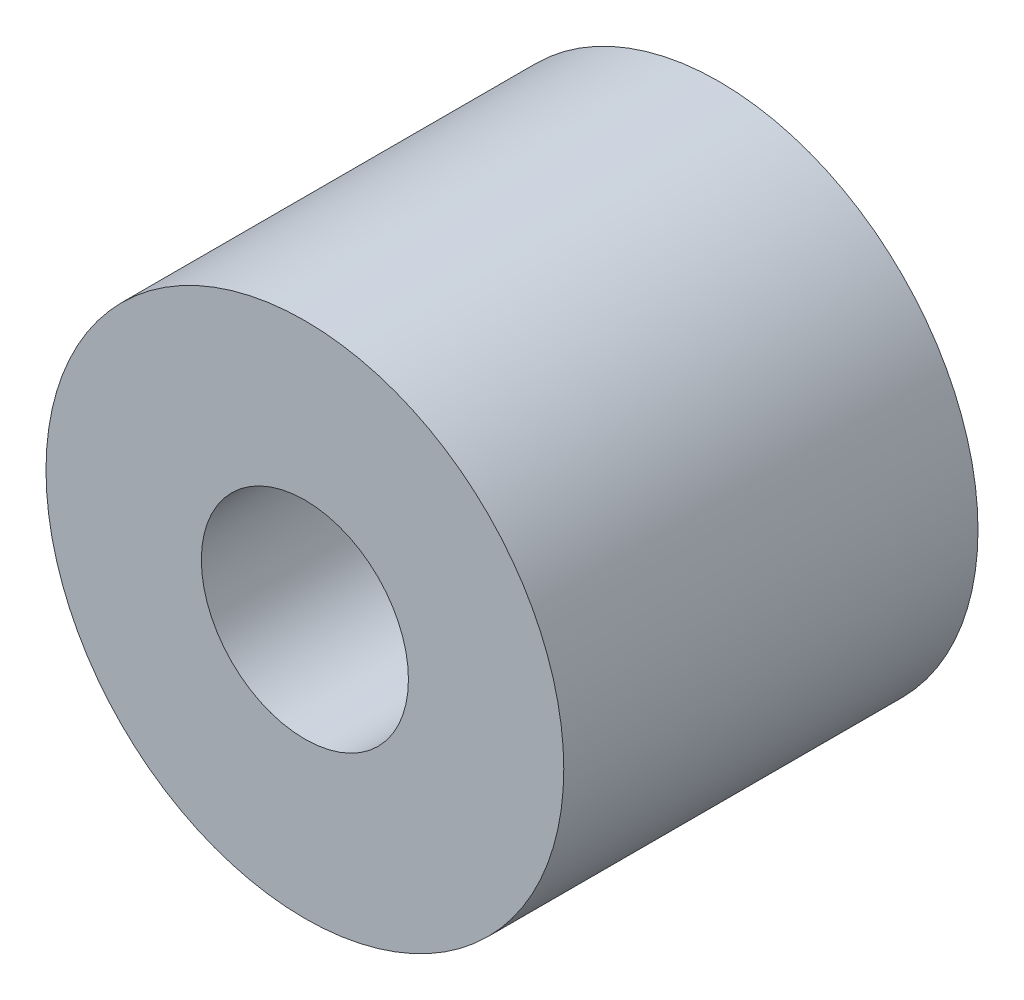
ISO-10303-21;
HEADER;
FILE_DESCRIPTION(('STEP AP214'),'2;1');
FILE_NAME('part.step','',(''),(''),'','','');
FILE_SCHEMA(('AUTOMOTIVE_DESIGN { 1 0 10303 214 1 1 1 1 }'));
ENDSEC;
DATA;
#1=APPLICATION_CONTEXT('core data for automotive mechanical design processes');
#2=APPLICATION_PROTOCOL_DEFINITION('international standard','automotive_design',2000,#1);
#3=PRODUCT_CONTEXT('',#1,'mechanical');
#4=PRODUCT('Part','Part','',(#3));
#5=PRODUCT_RELATED_PRODUCT_CATEGORY('part','',(#4));
#6=PRODUCT_DEFINITION_FORMATION('','',#4);
#7=PRODUCT_DEFINITION_CONTEXT('part definition',#1,'design');
#8=PRODUCT_DEFINITION('design','',#6,#7);
#9=PRODUCT_DEFINITION_SHAPE('','',#8);
#10=(LENGTH_UNIT() NAMED_UNIT(*) SI_UNIT(.MILLI.,.METRE.));
#11=(NAMED_UNIT(*) PLANE_ANGLE_UNIT() SI_UNIT($,.RADIAN.));
#12=(NAMED_UNIT(*) SI_UNIT($,.STERADIAN.) SOLID_ANGLE_UNIT());
#13=UNCERTAINTY_MEASURE_WITH_UNIT(LENGTH_MEASURE(1.E-05),#10,'distance_accuracy_value','');
#14=(GEOMETRIC_REPRESENTATION_CONTEXT(3) GLOBAL_UNCERTAINTY_ASSIGNED_CONTEXT((#13)) GLOBAL_UNIT_ASSIGNED_CONTEXT((#10,
#11,#12)) REPRESENTATION_CONTEXT('',''));
#15=CARTESIAN_POINT('',(0.,0.,0.));
#16=DIRECTION('',(0.,0.,1.));
#17=DIRECTION('',(1.,0.,0.));
#18=AXIS2_PLACEMENT_3D('',#15,#16,#17);
#19=CARTESIAN_POINT('',(0.,0.,12.7));
#20=DIRECTION('',(0.,0.,1.));
#21=DIRECTION('',(1.,0.,0.));
#22=AXIS2_PLACEMENT_3D('',#19,#20,#21);
#23=PLANE('',#22);
#24=CARTESIAN_POINT('',(0.,0.,12.7));
#25=DIRECTION('',(0.,0.,1.));
#26=DIRECTION('',(1.,0.,0.));
#27=AXIS2_PLACEMENT_3D('',#24,#25,#26);
#28=CIRCLE('',#27,7.9375);
#29=CARTESIAN_POINT('',(7.9375,0.,12.7));
#30=VERTEX_POINT('',#29);
#31=EDGE_CURVE('E10',#30,#30,#28,.T.);
#32=ORIENTED_EDGE('',*,*,#31,.T.);
#33=EDGE_LOOP('',(#32));
#34=FACE_BOUND('',#33,.T.);
#35=CARTESIAN_POINT('',(0.,0.,12.7));
#36=DIRECTION('',(0.,0.,1.));
#37=DIRECTION('',(1.,0.,0.));
#38=AXIS2_PLACEMENT_3D('',#35,#36,#37);
#39=CIRCLE('',#38,3.175);
#40=CARTESIAN_POINT('',(3.175,0.,12.7));
#41=VERTEX_POINT('',#40);
#42=EDGE_CURVE('E43',#41,#41,#39,.T.);
#43=ORIENTED_EDGE('',*,*,#42,.F.);
#44=EDGE_LOOP('',(#43));
#45=FACE_BOUND('',#44,.T.);
#46=ADVANCED_FACE('F32',(#34,#45),#23,.T.);
#47=CARTESIAN_POINT('',(0.,0.,0.));
#48=DIRECTION('',(0.,0.,1.));
#49=DIRECTION('',(1.,0.,0.));
#50=AXIS2_PLACEMENT_3D('',#47,#48,#49);
#51=PLANE('',#50);
#52=CARTESIAN_POINT('',(0.,0.,0.));
#53=DIRECTION('',(0.,0.,1.));
#54=DIRECTION('',(1.,0.,0.));
#55=AXIS2_PLACEMENT_3D('',#52,#53,#54);
#56=CIRCLE('',#55,7.9375);
#57=CARTESIAN_POINT('',(7.9375,0.,0.));
#58=VERTEX_POINT('',#57);
#59=EDGE_CURVE('E36',#58,#58,#56,.T.);
#60=ORIENTED_EDGE('',*,*,#59,.F.);
#61=EDGE_LOOP('',(#60));
#62=FACE_BOUND('',#61,.T.);
#63=CARTESIAN_POINT('',(0.,0.,0.));
#64=DIRECTION('',(0.,0.,1.));
#65=DIRECTION('',(1.,0.,0.));
#66=AXIS2_PLACEMENT_3D('',#63,#64,#65);
#67=CIRCLE('',#66,3.175);
#68=CARTESIAN_POINT('',(3.175,0.,0.));
#69=VERTEX_POINT('',#68);
#70=EDGE_CURVE('E45',#69,#69,#67,.T.);
#71=ORIENTED_EDGE('',*,*,#70,.T.);
#72=EDGE_LOOP('',(#71));
#73=FACE_BOUND('',#72,.T.);
#74=ADVANCED_FACE('F55',(#62,#73),#51,.F.);
#75=CARTESIAN_POINT('',(0.,0.,12.7));
#76=DIRECTION('',(0.,0.,-1.));
#77=DIRECTION('',(-1.,0.,0.));
#78=AXIS2_PLACEMENT_3D('',#75,#76,#77);
#79=CYLINDRICAL_SURFACE('',#78,7.9375);
#80=ORIENTED_EDGE('',*,*,#31,.F.);
#81=EDGE_LOOP('',(#80));
#82=FACE_BOUND('',#81,.T.);
#83=ORIENTED_EDGE('',*,*,#59,.T.);
#84=EDGE_LOOP('',(#83));
#85=FACE_BOUND('',#84,.T.);
#86=ADVANCED_FACE('F34',(#82,#85),#79,.T.);
#87=CARTESIAN_POINT('',(0.,0.,12.7));
#88=DIRECTION('',(0.,0.,-1.));
#89=DIRECTION('',(-1.,0.,0.));
#90=AXIS2_PLACEMENT_3D('',#87,#88,#89);
#91=CYLINDRICAL_SURFACE('',#90,3.175);
#92=ORIENTED_EDGE('',*,*,#42,.T.);
#93=EDGE_LOOP('',(#92));
#94=FACE_BOUND('',#93,.T.);
#95=ORIENTED_EDGE('',*,*,#70,.F.);
#96=EDGE_LOOP('',(#95));
#97=FACE_BOUND('',#96,.T.);
#98=ADVANCED_FACE('F51',(#94,#97),#91,.F.);
#99=CLOSED_SHELL('',(#46,#74,#86,#98));
#100=MANIFOLD_SOLID_BREP('B2',#99);
#101=ADVANCED_BREP_SHAPE_REPRESENTATION('',(#18,#100),#14);
#102=SHAPE_DEFINITION_REPRESENTATION(#9,#101);
ENDSEC;
END-ISO-10303-21;
